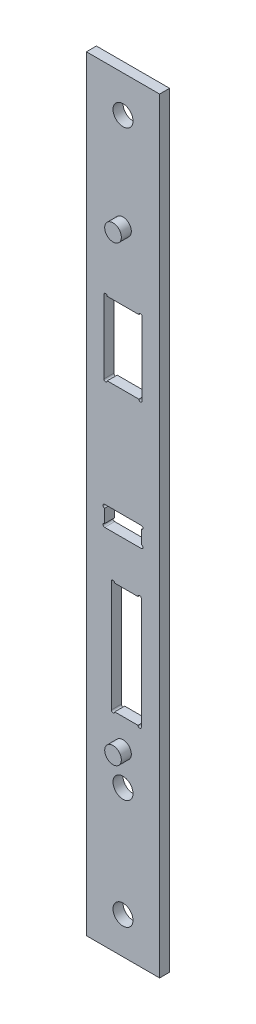
ISO-10303-21;
HEADER;
FILE_DESCRIPTION(('STEP AP214'),'2;1');
FILE_NAME('part.step','',(''),(''),'','','');
FILE_SCHEMA(('AUTOMOTIVE_DESIGN { 1 0 10303 214 1 1 1 1 }'));
ENDSEC;
DATA;
#1=APPLICATION_CONTEXT('core data for automotive mechanical design processes');
#2=APPLICATION_PROTOCOL_DEFINITION('international standard','automotive_design',2000,#1);
#3=PRODUCT_CONTEXT('',#1,'mechanical');
#4=PRODUCT('Part','Part','',(#3));
#5=PRODUCT_RELATED_PRODUCT_CATEGORY('part','',(#4));
#6=PRODUCT_DEFINITION_FORMATION('','',#4);
#7=PRODUCT_DEFINITION_CONTEXT('part definition',#1,'design');
#8=PRODUCT_DEFINITION('design','',#6,#7);
#9=PRODUCT_DEFINITION_SHAPE('','',#8);
#10=(LENGTH_UNIT() NAMED_UNIT(*) SI_UNIT(.MILLI.,.METRE.));
#11=(NAMED_UNIT(*) PLANE_ANGLE_UNIT() SI_UNIT($,.RADIAN.));
#12=(NAMED_UNIT(*) SI_UNIT($,.STERADIAN.) SOLID_ANGLE_UNIT());
#13=UNCERTAINTY_MEASURE_WITH_UNIT(LENGTH_MEASURE(1.E-05),#10,'distance_accuracy_value','');
#14=(GEOMETRIC_REPRESENTATION_CONTEXT(3) GLOBAL_UNCERTAINTY_ASSIGNED_CONTEXT((#13)) GLOBAL_UNIT_ASSIGNED_CONTEXT((#10,
#11,#12)) REPRESENTATION_CONTEXT('',''));
#15=CARTESIAN_POINT('',(0.,0.,0.));
#16=DIRECTION('',(0.,0.,1.));
#17=DIRECTION('',(1.,0.,0.));
#18=AXIS2_PLACEMENT_3D('',#15,#16,#17);
#19=CARTESIAN_POINT('',(-11.,-115.,1.5));
#20=DIRECTION('',(0.,0.,1.));
#21=DIRECTION('',(1.,0.,0.));
#22=AXIS2_PLACEMENT_3D('',#19,#20,#21);
#23=PLANE('',#22);
#24=CARTESIAN_POINT('',(0.,75.,1.5));
#25=DIRECTION('',(0.,0.,1.));
#26=DIRECTION('',(1.,0.,0.));
#27=AXIS2_PLACEMENT_3D('',#24,#25,#26);
#28=CIRCLE('',#27,2.5);
#29=CARTESIAN_POINT('',(2.50000000000004,75.,1.5));
#30=VERTEX_POINT('',#29);
#31=EDGE_CURVE('E619',#30,#30,#28,.T.);
#32=ORIENTED_EDGE('',*,*,#31,.F.);
#33=EDGE_LOOP('',(#32));
#34=FACE_BOUND('',#33,.T.);
#35=CARTESIAN_POINT('',(-2.99999999999997,-19.,1.5));
#36=DIRECTION('',(0.,0.,1.));
#37=DIRECTION('',(1.,0.,0.));
#38=AXIS2_PLACEMENT_3D('',#35,#36,#37);
#39=CIRCLE('',#38,0.499999999999999);
#40=CARTESIAN_POINT('',(-2.49999999999997,-19.,1.5));
#41=VERTEX_POINT('',#40);
#42=CARTESIAN_POINT('',(-3.49999999999996,-19.,1.5));
#43=VERTEX_POINT('',#42);
#44=EDGE_CURVE('E55',#41,#43,#39,.T.);
#45=ORIENTED_EDGE('',*,*,#44,.F.);
#46=DIRECTION('',(-1.,0.,0.));
#47=VECTOR('',#46,1.);
#48=CARTESIAN_POINT('',(-2.49999999999997,-19.,1.5));
#49=LINE('',#48,#47);
#50=CARTESIAN_POINT('',(4.50000000000004,-19.,1.5));
#51=VERTEX_POINT('',#50);
#52=EDGE_CURVE('E225',#51,#41,#49,.T.);
#53=ORIENTED_EDGE('',*,*,#52,.F.);
#54=CARTESIAN_POINT('',(5.00000000000003,-19.,1.5));
#55=DIRECTION('',(0.,0.,1.));
#56=DIRECTION('',(-1.,0.,0.));
#57=AXIS2_PLACEMENT_3D('',#54,#55,#56);
#58=CIRCLE('',#57,0.5);
#59=CARTESIAN_POINT('',(5.50000000000003,-19.,1.5));
#60=VERTEX_POINT('',#59);
#61=EDGE_CURVE('E259',#60,#51,#58,.T.);
#62=ORIENTED_EDGE('',*,*,#61,.F.);
#63=DIRECTION('',(0.,1.,0.));
#64=VECTOR('',#63,1.);
#65=CARTESIAN_POINT('',(5.50000000000003,-19.,1.5));
#66=LINE('',#65,#64);
#67=CARTESIAN_POINT('',(5.50000000000004,-52.5,1.5));
#68=VERTEX_POINT('',#67);
#69=EDGE_CURVE('E256',#68,#60,#66,.T.);
#70=ORIENTED_EDGE('',*,*,#69,.F.);
#71=CARTESIAN_POINT('',(5.00000000000003,-52.5,1.5));
#72=DIRECTION('',(0.,0.,1.));
#73=DIRECTION('',(-1.,0.,0.));
#74=AXIS2_PLACEMENT_3D('',#71,#72,#73);
#75=CIRCLE('',#74,0.500000000000002);
#76=CARTESIAN_POINT('',(4.50000000000003,-52.5,1.5));
#77=VERTEX_POINT('',#76);
#78=EDGE_CURVE('E253',#77,#68,#75,.T.);
#79=ORIENTED_EDGE('',*,*,#78,.F.);
#80=DIRECTION('',(1.,0.,0.));
#81=VECTOR('',#80,1.);
#82=CARTESIAN_POINT('',(-2.49999999999997,-52.5,1.5));
#83=LINE('',#82,#81);
#84=CARTESIAN_POINT('',(-2.49999999999997,-52.5,1.5));
#85=VERTEX_POINT('',#84);
#86=EDGE_CURVE('E250',#85,#77,#83,.T.);
#87=ORIENTED_EDGE('',*,*,#86,.F.);
#88=CARTESIAN_POINT('',(-2.99999999999997,-52.5,1.5));
#89=DIRECTION('',(0.,0.,1.));
#90=DIRECTION('',(1.,0.,0.));
#91=AXIS2_PLACEMENT_3D('',#88,#89,#90);
#92=CIRCLE('',#91,0.499999999999999);
#93=CARTESIAN_POINT('',(-3.49999999999997,-52.5,1.5));
#94=VERTEX_POINT('',#93);
#95=EDGE_CURVE('E247',#94,#85,#92,.T.);
#96=ORIENTED_EDGE('',*,*,#95,.F.);
#97=DIRECTION('',(0.,-1.,0.));
#98=VECTOR('',#97,1.);
#99=CARTESIAN_POINT('',(-3.49999999999997,-19.,1.5));
#100=LINE('',#99,#98);
#101=EDGE_CURVE('E240',#43,#94,#100,.T.);
#102=ORIENTED_EDGE('',*,*,#101,.F.);
#103=EDGE_LOOP('',(#45,#53,#62,#70,#79,#87,#96,#102));
#104=FACE_BOUND('',#103,.T.);
#105=CARTESIAN_POINT('',(-5.5,-0.5,1.5));
#106=DIRECTION('',(0.,0.,1.));
#107=DIRECTION('',(1.,0.,0.));
#108=AXIS2_PLACEMENT_3D('',#105,#106,#107);
#109=CIRCLE('',#108,0.5);
#110=CARTESIAN_POINT('',(-5.5,0.,1.5));
#111=VERTEX_POINT('',#110);
#112=CARTESIAN_POINT('',(-5.5,-1.,1.5));
#113=VERTEX_POINT('',#112);
#114=EDGE_CURVE('E295',#111,#113,#109,.T.);
#115=ORIENTED_EDGE('',*,*,#114,.F.);
#116=DIRECTION('',(-1.,0.,0.));
#117=VECTOR('',#116,1.);
#118=CARTESIAN_POINT('',(-5.5,0.,1.5));
#119=LINE('',#118,#117);
#120=CARTESIAN_POINT('',(5.5,0.,1.5));
#121=VERTEX_POINT('',#120);
#122=EDGE_CURVE('E315',#121,#111,#119,.T.);
#123=ORIENTED_EDGE('',*,*,#122,.F.);
#124=CARTESIAN_POINT('',(5.5,-0.5,1.5));
#125=DIRECTION('',(0.,0.,1.));
#126=DIRECTION('',(-1.,0.,0.));
#127=AXIS2_PLACEMENT_3D('',#124,#125,#126);
#128=CIRCLE('',#127,0.5);
#129=CARTESIAN_POINT('',(5.5,-1.,1.5));
#130=VERTEX_POINT('',#129);
#131=EDGE_CURVE('E312',#130,#121,#128,.T.);
#132=ORIENTED_EDGE('',*,*,#131,.F.);
#133=DIRECTION('',(0.,1.,0.));
#134=VECTOR('',#133,1.);
#135=CARTESIAN_POINT('',(5.5,-1.,1.5));
#136=LINE('',#135,#134);
#137=CARTESIAN_POINT('',(5.5,-5.,1.5));
#138=VERTEX_POINT('',#137);
#139=EDGE_CURVE('E309',#138,#130,#136,.T.);
#140=ORIENTED_EDGE('',*,*,#139,.F.);
#141=CARTESIAN_POINT('',(5.5,-5.5,1.5));
#142=DIRECTION('',(0.,0.,1.));
#143=DIRECTION('',(-1.,0.,0.));
#144=AXIS2_PLACEMENT_3D('',#141,#142,#143);
#145=CIRCLE('',#144,0.5);
#146=CARTESIAN_POINT('',(5.5,-6.,1.5));
#147=VERTEX_POINT('',#146);
#148=EDGE_CURVE('E306',#147,#138,#145,.T.);
#149=ORIENTED_EDGE('',*,*,#148,.F.);
#150=DIRECTION('',(1.,0.,0.));
#151=VECTOR('',#150,1.);
#152=CARTESIAN_POINT('',(-5.5,-6.,1.5));
#153=LINE('',#152,#151);
#154=CARTESIAN_POINT('',(-5.5,-6.,1.5));
#155=VERTEX_POINT('',#154);
#156=EDGE_CURVE('E303',#155,#147,#153,.T.);
#157=ORIENTED_EDGE('',*,*,#156,.F.);
#158=CARTESIAN_POINT('',(-5.5,-5.5,1.5));
#159=DIRECTION('',(0.,0.,1.));
#160=DIRECTION('',(1.,0.,0.));
#161=AXIS2_PLACEMENT_3D('',#158,#159,#160);
#162=CIRCLE('',#161,0.5);
#163=CARTESIAN_POINT('',(-5.5,-5.,1.5));
#164=VERTEX_POINT('',#163);
#165=EDGE_CURVE('E300',#164,#155,#162,.T.);
#166=ORIENTED_EDGE('',*,*,#165,.F.);
#167=DIRECTION('',(0.,-1.,0.));
#168=VECTOR('',#167,1.);
#169=CARTESIAN_POINT('',(-5.5,-1.,1.5));
#170=LINE('',#169,#168);
#171=EDGE_CURVE('E297',#113,#164,#170,.T.);
#172=ORIENTED_EDGE('',*,*,#171,.F.);
#173=EDGE_LOOP('',(#115,#123,#132,#140,#149,#157,#166,#172));
#174=FACE_BOUND('',#173,.T.);
#175=CARTESIAN_POINT('',(-5.25,54.5,1.5));
#176=DIRECTION('',(0.,0.,1.));
#177=DIRECTION('',(1.,0.,0.));
#178=AXIS2_PLACEMENT_3D('',#175,#176,#177);
#179=CIRCLE('',#178,0.5);
#180=CARTESIAN_POINT('',(-4.75,54.5,1.5));
#181=VERTEX_POINT('',#180);
#182=CARTESIAN_POINT('',(-5.75,54.5,1.5));
#183=VERTEX_POINT('',#182);
#184=EDGE_CURVE('E358',#181,#183,#179,.T.);
#185=ORIENTED_EDGE('',*,*,#184,.F.);
#186=DIRECTION('',(-1.,0.,0.));
#187=VECTOR('',#186,1.);
#188=CARTESIAN_POINT('',(-4.75,54.5,1.5));
#189=LINE('',#188,#187);
#190=CARTESIAN_POINT('',(4.75,54.5,1.5));
#191=VERTEX_POINT('',#190);
#192=EDGE_CURVE('E378',#191,#181,#189,.T.);
#193=ORIENTED_EDGE('',*,*,#192,.F.);
#194=CARTESIAN_POINT('',(5.25,54.5,1.5));
#195=DIRECTION('',(0.,0.,1.));
#196=DIRECTION('',(1.,0.,0.));
#197=AXIS2_PLACEMENT_3D('',#194,#195,#196);
#198=CIRCLE('',#197,0.5);
#199=CARTESIAN_POINT('',(5.75,54.5,1.5));
#200=VERTEX_POINT('',#199);
#201=EDGE_CURVE('E375',#200,#191,#198,.T.);
#202=ORIENTED_EDGE('',*,*,#201,.F.);
#203=DIRECTION('',(0.,1.,0.));
#204=VECTOR('',#203,1.);
#205=CARTESIAN_POINT('',(5.75,54.5,1.5));
#206=LINE('',#205,#204);
#207=CARTESIAN_POINT('',(5.75,32.5,1.5));
#208=VERTEX_POINT('',#207);
#209=EDGE_CURVE('E372',#208,#200,#206,.T.);
#210=ORIENTED_EDGE('',*,*,#209,.F.);
#211=CARTESIAN_POINT('',(5.25,32.5,1.5));
#212=DIRECTION('',(0.,0.,1.));
#213=DIRECTION('',(-1.,0.,0.));
#214=AXIS2_PLACEMENT_3D('',#211,#212,#213);
#215=CIRCLE('',#214,0.5);
#216=CARTESIAN_POINT('',(4.75,32.5,1.5));
#217=VERTEX_POINT('',#216);
#218=EDGE_CURVE('E369',#217,#208,#215,.T.);
#219=ORIENTED_EDGE('',*,*,#218,.F.);
#220=DIRECTION('',(1.,0.,0.));
#221=VECTOR('',#220,1.);
#222=CARTESIAN_POINT('',(-4.75,32.5,1.5));
#223=LINE('',#222,#221);
#224=CARTESIAN_POINT('',(-4.75,32.5,1.5));
#225=VERTEX_POINT('',#224);
#226=EDGE_CURVE('E366',#225,#217,#223,.T.);
#227=ORIENTED_EDGE('',*,*,#226,.F.);
#228=CARTESIAN_POINT('',(-5.25,32.5,1.5));
#229=DIRECTION('',(0.,0.,1.));
#230=DIRECTION('',(1.,0.,0.));
#231=AXIS2_PLACEMENT_3D('',#228,#229,#230);
#232=CIRCLE('',#231,0.5);
#233=CARTESIAN_POINT('',(-5.75,32.5,1.5));
#234=VERTEX_POINT('',#233);
#235=EDGE_CURVE('E363',#234,#225,#232,.T.);
#236=ORIENTED_EDGE('',*,*,#235,.F.);
#237=DIRECTION('',(0.,-1.,0.));
#238=VECTOR('',#237,1.);
#239=CARTESIAN_POINT('',(-5.75,54.5,1.5));
#240=LINE('',#239,#238);
#241=EDGE_CURVE('E360',#183,#234,#240,.T.);
#242=ORIENTED_EDGE('',*,*,#241,.F.);
#243=EDGE_LOOP('',(#185,#193,#202,#210,#219,#227,#236,#242));
#244=FACE_BOUND('',#243,.T.);
#245=CARTESIAN_POINT('',(0.,104.,1.5));
#246=DIRECTION('',(0.,0.,1.));
#247=DIRECTION('',(1.,0.,0.));
#248=AXIS2_PLACEMENT_3D('',#245,#246,#247);
#249=CIRCLE('',#248,3.);
#250=CARTESIAN_POINT('',(3.00000000000004,104.,1.5));
#251=VERTEX_POINT('',#250);
#252=EDGE_CURVE('E401',#251,#251,#249,.T.);
#253=ORIENTED_EDGE('',*,*,#252,.F.);
#254=EDGE_LOOP('',(#253));
#255=FACE_BOUND('',#254,.T.);
#256=CARTESIAN_POINT('',(0.,-71.,1.5));
#257=DIRECTION('',(0.,0.,1.));
#258=DIRECTION('',(1.,0.,0.));
#259=AXIS2_PLACEMENT_3D('',#256,#257,#258);
#260=CIRCLE('',#259,3.);
#261=CARTESIAN_POINT('',(3.,-71.,1.5));
#262=VERTEX_POINT('',#261);
#263=EDGE_CURVE('E407',#262,#262,#260,.T.);
#264=ORIENTED_EDGE('',*,*,#263,.F.);
#265=EDGE_LOOP('',(#264));
#266=FACE_BOUND('',#265,.T.);
#267=CARTESIAN_POINT('',(0.,-104.,1.5));
#268=DIRECTION('',(0.,0.,1.));
#269=DIRECTION('',(1.,0.,0.));
#270=AXIS2_PLACEMENT_3D('',#267,#268,#269);
#271=CIRCLE('',#270,3.);
#272=CARTESIAN_POINT('',(3.,-104.,1.5));
#273=VERTEX_POINT('',#272);
#274=EDGE_CURVE('E413',#273,#273,#271,.T.);
#275=ORIENTED_EDGE('',*,*,#274,.F.);
#276=EDGE_LOOP('',(#275));
#277=FACE_BOUND('',#276,.T.);
#278=DIRECTION('',(0.,-1.,0.));
#279=VECTOR('',#278,1.);
#280=CARTESIAN_POINT('',(-11.,115.,1.5));
#281=LINE('',#280,#279);
#282=CARTESIAN_POINT('',(-11.,115.,1.5));
#283=VERTEX_POINT('',#282);
#284=CARTESIAN_POINT('',(-11.,-115.,1.5));
#285=VERTEX_POINT('',#284);
#286=EDGE_CURVE('E420',#283,#285,#281,.T.);
#287=ORIENTED_EDGE('',*,*,#286,.T.);
#288=DIRECTION('',(1.,0.,0.));
#289=VECTOR('',#288,1.);
#290=CARTESIAN_POINT('',(-11.,-115.,1.5));
#291=LINE('',#290,#289);
#292=CARTESIAN_POINT('',(11.,-115.,1.5));
#293=VERTEX_POINT('',#292);
#294=EDGE_CURVE('E424',#285,#293,#291,.T.);
#295=ORIENTED_EDGE('',*,*,#294,.T.);
#296=DIRECTION('',(0.,1.,0.));
#297=VECTOR('',#296,1.);
#298=CARTESIAN_POINT('',(11.,115.,1.5));
#299=LINE('',#298,#297);
#300=CARTESIAN_POINT('',(11.,115.,1.5));
#301=VERTEX_POINT('',#300);
#302=EDGE_CURVE('E427',#293,#301,#299,.T.);
#303=ORIENTED_EDGE('',*,*,#302,.T.);
#304=DIRECTION('',(-1.,0.,0.));
#305=VECTOR('',#304,1.);
#306=CARTESIAN_POINT('',(-11.,115.,1.5));
#307=LINE('',#306,#305);
#308=EDGE_CURVE('E430',#301,#283,#307,.T.);
#309=ORIENTED_EDGE('',*,*,#308,.T.);
#310=EDGE_LOOP('',(#287,#295,#303,#309));
#311=FACE_BOUND('',#310,.T.);
#312=CARTESIAN_POINT('',(0.,-61.,1.5));
#313=DIRECTION('',(0.,0.,1.));
#314=DIRECTION('',(1.,0.,0.));
#315=AXIS2_PLACEMENT_3D('',#312,#313,#314);
#316=CIRCLE('',#315,2.5);
#317=CARTESIAN_POINT('',(2.50000000000004,-61.,1.5));
#318=VERTEX_POINT('',#317);
#319=EDGE_CURVE('E620',#318,#318,#316,.T.);
#320=ORIENTED_EDGE('',*,*,#319,.F.);
#321=EDGE_LOOP('',(#320));
#322=FACE_BOUND('',#321,.T.);
#323=ADVANCED_FACE('F32',(#34,#104,#174,#244,#255,#266,#277,#311,#322),#23,.T.);
#324=CARTESIAN_POINT('',(-11.,-115.,-1.5));
#325=DIRECTION('',(0.,0.,1.));
#326=DIRECTION('',(1.,0.,0.));
#327=AXIS2_PLACEMENT_3D('',#324,#325,#326);
#328=PLANE('',#327);
#329=DIRECTION('',(1.,0.,0.));
#330=VECTOR('',#329,1.);
#331=CARTESIAN_POINT('',(-2.49999999999997,-19.,-1.5));
#332=LINE('',#331,#330);
#333=CARTESIAN_POINT('',(-2.49999999999997,-19.,-1.5));
#334=VERTEX_POINT('',#333);
#335=CARTESIAN_POINT('',(4.50000000000004,-19.,-1.5));
#336=VERTEX_POINT('',#335);
#337=EDGE_CURVE('E238',#334,#336,#332,.T.);
#338=ORIENTED_EDGE('',*,*,#337,.F.);
#339=CARTESIAN_POINT('',(-2.99999999999997,-19.,-1.5));
#340=DIRECTION('',(0.,0.,1.));
#341=DIRECTION('',(1.,0.,0.));
#342=AXIS2_PLACEMENT_3D('',#339,#340,#341);
#343=CIRCLE('',#342,0.499999999999999);
#344=CARTESIAN_POINT('',(-3.49999999999997,-19.,-1.5));
#345=VERTEX_POINT('',#344);
#346=EDGE_CURVE('E219',#345,#334,#343,.F.);
#347=ORIENTED_EDGE('',*,*,#346,.F.);
#348=DIRECTION('',(0.,1.,0.));
#349=VECTOR('',#348,1.);
#350=CARTESIAN_POINT('',(-3.49999999999997,-19.,-1.5));
#351=LINE('',#350,#349);
#352=CARTESIAN_POINT('',(-3.49999999999997,-52.5,-1.5));
#353=VERTEX_POINT('',#352);
#354=EDGE_CURVE('E228',#353,#345,#351,.T.);
#355=ORIENTED_EDGE('',*,*,#354,.F.);
#356=CARTESIAN_POINT('',(-2.99999999999997,-52.5,-1.5));
#357=DIRECTION('',(0.,0.,1.));
#358=DIRECTION('',(1.,0.,0.));
#359=AXIS2_PLACEMENT_3D('',#356,#357,#358);
#360=CIRCLE('',#359,0.499999999999999);
#361=CARTESIAN_POINT('',(-2.49999999999997,-52.5,-1.5));
#362=VERTEX_POINT('',#361);
#363=EDGE_CURVE('E47',#362,#353,#360,.F.);
#364=ORIENTED_EDGE('',*,*,#363,.F.);
#365=DIRECTION('',(-1.,0.,0.));
#366=VECTOR('',#365,1.);
#367=CARTESIAN_POINT('',(-2.49999999999997,-52.5,-1.5));
#368=LINE('',#367,#366);
#369=CARTESIAN_POINT('',(4.50000000000003,-52.5,-1.5));
#370=VERTEX_POINT('',#369);
#371=EDGE_CURVE('E631',#370,#362,#368,.T.);
#372=ORIENTED_EDGE('',*,*,#371,.F.);
#373=CARTESIAN_POINT('',(5.00000000000003,-52.5,-1.5));
#374=DIRECTION('',(0.,0.,1.));
#375=DIRECTION('',(1.,0.,0.));
#376=AXIS2_PLACEMENT_3D('',#373,#374,#375);
#377=CIRCLE('',#376,0.500000000000002);
#378=CARTESIAN_POINT('',(5.50000000000004,-52.5,-1.5));
#379=VERTEX_POINT('',#378);
#380=EDGE_CURVE('E634',#379,#370,#377,.F.);
#381=ORIENTED_EDGE('',*,*,#380,.F.);
#382=DIRECTION('',(0.,-1.,0.));
#383=VECTOR('',#382,1.);
#384=CARTESIAN_POINT('',(5.50000000000003,-19.,-1.5));
#385=LINE('',#384,#383);
#386=CARTESIAN_POINT('',(5.50000000000003,-19.,-1.5));
#387=VERTEX_POINT('',#386);
#388=EDGE_CURVE('E637',#387,#379,#385,.T.);
#389=ORIENTED_EDGE('',*,*,#388,.F.);
#390=CARTESIAN_POINT('',(5.00000000000003,-19.,-1.5));
#391=DIRECTION('',(0.,0.,1.));
#392=DIRECTION('',(1.,0.,0.));
#393=AXIS2_PLACEMENT_3D('',#390,#391,#392);
#394=CIRCLE('',#393,0.5);
#395=EDGE_CURVE('E242',#336,#387,#394,.F.);
#396=ORIENTED_EDGE('',*,*,#395,.F.);
#397=EDGE_LOOP('',(#338,#347,#355,#364,#372,#381,#389,#396));
#398=FACE_BOUND('',#397,.T.);
#399=DIRECTION('',(1.,0.,0.));
#400=VECTOR('',#399,1.);
#401=CARTESIAN_POINT('',(-5.5,0.,-1.5));
#402=LINE('',#401,#400);
#403=CARTESIAN_POINT('',(-5.5,0.,-1.5));
#404=VERTEX_POINT('',#403);
#405=CARTESIAN_POINT('',(5.5,0.,-1.5));
#406=VERTEX_POINT('',#405);
#407=EDGE_CURVE('E289',#404,#406,#402,.T.);
#408=ORIENTED_EDGE('',*,*,#407,.F.);
#409=CARTESIAN_POINT('',(-5.5,-0.5,-1.5));
#410=DIRECTION('',(0.,0.,1.));
#411=DIRECTION('',(1.,0.,0.));
#412=AXIS2_PLACEMENT_3D('',#409,#410,#411);
#413=CIRCLE('',#412,0.5);
#414=CARTESIAN_POINT('',(-5.5,-1.,-1.5));
#415=VERTEX_POINT('',#414);
#416=EDGE_CURVE('E292',#415,#404,#413,.F.);
#417=ORIENTED_EDGE('',*,*,#416,.F.);
#418=DIRECTION('',(0.,1.,0.));
#419=VECTOR('',#418,1.);
#420=CARTESIAN_POINT('',(-5.5,-1.,-1.5));
#421=LINE('',#420,#419);
#422=CARTESIAN_POINT('',(-5.5,-5.,-1.5));
#423=VERTEX_POINT('',#422);
#424=EDGE_CURVE('E321',#423,#415,#421,.T.);
#425=ORIENTED_EDGE('',*,*,#424,.F.);
#426=CARTESIAN_POINT('',(-5.5,-5.5,-1.5));
#427=DIRECTION('',(0.,0.,1.));
#428=DIRECTION('',(1.,0.,0.));
#429=AXIS2_PLACEMENT_3D('',#426,#427,#428);
#430=CIRCLE('',#429,0.5);
#431=CARTESIAN_POINT('',(-5.5,-6.,-1.5));
#432=VERTEX_POINT('',#431);
#433=EDGE_CURVE('E231',#432,#423,#430,.F.);
#434=ORIENTED_EDGE('',*,*,#433,.F.);
#435=DIRECTION('',(-1.,0.,0.));
#436=VECTOR('',#435,1.);
#437=CARTESIAN_POINT('',(-5.5,-6.,-1.5));
#438=LINE('',#437,#436);
#439=CARTESIAN_POINT('',(5.5,-6.,-1.5));
#440=VERTEX_POINT('',#439);
#441=EDGE_CURVE('E277',#440,#432,#438,.T.);
#442=ORIENTED_EDGE('',*,*,#441,.F.);
#443=CARTESIAN_POINT('',(5.5,-5.5,-1.5));
#444=DIRECTION('',(0.,0.,1.));
#445=DIRECTION('',(1.,0.,0.));
#446=AXIS2_PLACEMENT_3D('',#443,#444,#445);
#447=CIRCLE('',#446,0.5);
#448=CARTESIAN_POINT('',(5.5,-5.,-1.5));
#449=VERTEX_POINT('',#448);
#450=EDGE_CURVE('E280',#449,#440,#447,.F.);
#451=ORIENTED_EDGE('',*,*,#450,.F.);
#452=DIRECTION('',(0.,-1.,0.));
#453=VECTOR('',#452,1.);
#454=CARTESIAN_POINT('',(5.5,-1.,-1.5));
#455=LINE('',#454,#453);
#456=CARTESIAN_POINT('',(5.5,-1.,-1.5));
#457=VERTEX_POINT('',#456);
#458=EDGE_CURVE('E283',#457,#449,#455,.T.);
#459=ORIENTED_EDGE('',*,*,#458,.F.);
#460=CARTESIAN_POINT('',(5.5,-0.5,-1.5));
#461=DIRECTION('',(0.,0.,1.));
#462=DIRECTION('',(1.,0.,0.));
#463=AXIS2_PLACEMENT_3D('',#460,#461,#462);
#464=CIRCLE('',#463,0.5);
#465=EDGE_CURVE('E286',#406,#457,#464,.F.);
#466=ORIENTED_EDGE('',*,*,#465,.F.);
#467=EDGE_LOOP('',(#408,#417,#425,#434,#442,#451,#459,#466));
#468=FACE_BOUND('',#467,.T.);
#469=DIRECTION('',(1.,0.,0.));
#470=VECTOR('',#469,1.);
#471=CARTESIAN_POINT('',(-4.75,54.5,-1.5));
#472=LINE('',#471,#470);
#473=CARTESIAN_POINT('',(-4.75,54.5,-1.5));
#474=VERTEX_POINT('',#473);
#475=CARTESIAN_POINT('',(4.75,54.5,-1.5));
#476=VERTEX_POINT('',#475);
#477=EDGE_CURVE('E352',#474,#476,#472,.T.);
#478=ORIENTED_EDGE('',*,*,#477,.F.);
#479=CARTESIAN_POINT('',(-5.25,54.5,-1.5));
#480=DIRECTION('',(0.,0.,1.));
#481=DIRECTION('',(1.,0.,0.));
#482=AXIS2_PLACEMENT_3D('',#479,#480,#481);
#483=CIRCLE('',#482,0.5);
#484=CARTESIAN_POINT('',(-5.75,54.5,-1.5));
#485=VERTEX_POINT('',#484);
#486=EDGE_CURVE('E355',#485,#474,#483,.F.);
#487=ORIENTED_EDGE('',*,*,#486,.F.);
#488=DIRECTION('',(0.,1.,0.));
#489=VECTOR('',#488,1.);
#490=CARTESIAN_POINT('',(-5.75,54.5,-1.5));
#491=LINE('',#490,#489);
#492=CARTESIAN_POINT('',(-5.75,32.5,-1.5));
#493=VERTEX_POINT('',#492);
#494=EDGE_CURVE('E384',#493,#485,#491,.T.);
#495=ORIENTED_EDGE('',*,*,#494,.F.);
#496=CARTESIAN_POINT('',(-5.25,32.5,-1.5));
#497=DIRECTION('',(0.,0.,1.));
#498=DIRECTION('',(1.,0.,0.));
#499=AXIS2_PLACEMENT_3D('',#496,#497,#498);
#500=CIRCLE('',#499,0.5);
#501=CARTESIAN_POINT('',(-4.75,32.5,-1.5));
#502=VERTEX_POINT('',#501);
#503=EDGE_CURVE('E338',#502,#493,#500,.F.);
#504=ORIENTED_EDGE('',*,*,#503,.F.);
#505=DIRECTION('',(-1.,0.,0.));
#506=VECTOR('',#505,1.);
#507=CARTESIAN_POINT('',(-4.75,32.5,-1.5));
#508=LINE('',#507,#506);
#509=CARTESIAN_POINT('',(4.75,32.5,-1.5));
#510=VERTEX_POINT('',#509);
#511=EDGE_CURVE('E340',#510,#502,#508,.T.);
#512=ORIENTED_EDGE('',*,*,#511,.F.);
#513=CARTESIAN_POINT('',(5.25,32.5,-1.5));
#514=DIRECTION('',(0.,0.,1.));
#515=DIRECTION('',(1.,0.,0.));
#516=AXIS2_PLACEMENT_3D('',#513,#514,#515);
#517=CIRCLE('',#516,0.5);
#518=CARTESIAN_POINT('',(5.75,32.5,-1.5));
#519=VERTEX_POINT('',#518);
#520=EDGE_CURVE('E343',#519,#510,#517,.F.);
#521=ORIENTED_EDGE('',*,*,#520,.F.);
#522=DIRECTION('',(0.,-1.,0.));
#523=VECTOR('',#522,1.);
#524=CARTESIAN_POINT('',(5.75,54.5,-1.5));
#525=LINE('',#524,#523);
#526=CARTESIAN_POINT('',(5.75,54.5,-1.5));
#527=VERTEX_POINT('',#526);
#528=EDGE_CURVE('E346',#527,#519,#525,.T.);
#529=ORIENTED_EDGE('',*,*,#528,.F.);
#530=CARTESIAN_POINT('',(5.25,54.5,-1.5));
#531=DIRECTION('',(0.,0.,1.));
#532=DIRECTION('',(1.,0.,0.));
#533=AXIS2_PLACEMENT_3D('',#530,#531,#532);
#534=CIRCLE('',#533,0.5);
#535=EDGE_CURVE('E349',#476,#527,#534,.F.);
#536=ORIENTED_EDGE('',*,*,#535,.F.);
#537=EDGE_LOOP('',(#478,#487,#495,#504,#512,#521,#529,#536));
#538=FACE_BOUND('',#537,.T.);
#539=CARTESIAN_POINT('',(0.,104.,-1.5));
#540=DIRECTION('',(0.,0.,1.));
#541=DIRECTION('',(1.,0.,0.));
#542=AXIS2_PLACEMENT_3D('',#539,#540,#541);
#543=CIRCLE('',#542,3.);
#544=CARTESIAN_POINT('',(3.00000000000004,104.,-1.5));
#545=VERTEX_POINT('',#544);
#546=EDGE_CURVE('E404',#545,#545,#543,.F.);
#547=ORIENTED_EDGE('',*,*,#546,.F.);
#548=EDGE_LOOP('',(#547));
#549=FACE_BOUND('',#548,.T.);
#550=CARTESIAN_POINT('',(0.,-71.,-1.5));
#551=DIRECTION('',(0.,0.,1.));
#552=DIRECTION('',(1.,0.,0.));
#553=AXIS2_PLACEMENT_3D('',#550,#551,#552);
#554=CIRCLE('',#553,3.);
#555=CARTESIAN_POINT('',(3.,-71.,-1.5));
#556=VERTEX_POINT('',#555);
#557=EDGE_CURVE('E410',#556,#556,#554,.F.);
#558=ORIENTED_EDGE('',*,*,#557,.F.);
#559=EDGE_LOOP('',(#558));
#560=FACE_BOUND('',#559,.T.);
#561=DIRECTION('',(0.,-1.,0.));
#562=VECTOR('',#561,1.);
#563=CARTESIAN_POINT('',(-11.,115.,-1.5));
#564=LINE('',#563,#562);
#565=CARTESIAN_POINT('',(-11.,115.,-1.5));
#566=VERTEX_POINT('',#565);
#567=CARTESIAN_POINT('',(-11.,-115.,-1.5));
#568=VERTEX_POINT('',#567);
#569=EDGE_CURVE('E419',#566,#568,#564,.T.);
#570=ORIENTED_EDGE('',*,*,#569,.F.);
#571=DIRECTION('',(-1.,0.,0.));
#572=VECTOR('',#571,1.);
#573=CARTESIAN_POINT('',(-11.,115.,-1.5));
#574=LINE('',#573,#572);
#575=CARTESIAN_POINT('',(11.,115.,-1.5));
#576=VERTEX_POINT('',#575);
#577=EDGE_CURVE('E425',#576,#566,#574,.T.);
#578=ORIENTED_EDGE('',*,*,#577,.F.);
#579=DIRECTION('',(0.,1.,0.));
#580=VECTOR('',#579,1.);
#581=CARTESIAN_POINT('',(11.,115.,-1.5));
#582=LINE('',#581,#580);
#583=CARTESIAN_POINT('',(11.,-115.,-1.5));
#584=VERTEX_POINT('',#583);
#585=EDGE_CURVE('E437',#584,#576,#582,.T.);
#586=ORIENTED_EDGE('',*,*,#585,.F.);
#587=DIRECTION('',(1.,0.,0.));
#588=VECTOR('',#587,1.);
#589=CARTESIAN_POINT('',(-11.,-115.,-1.5));
#590=LINE('',#589,#588);
#591=EDGE_CURVE('E435',#568,#584,#590,.T.);
#592=ORIENTED_EDGE('',*,*,#591,.F.);
#593=EDGE_LOOP('',(#570,#578,#586,#592));
#594=FACE_BOUND('',#593,.T.);
#595=CARTESIAN_POINT('',(0.,-104.,-1.5));
#596=DIRECTION('',(0.,0.,1.));
#597=DIRECTION('',(1.,0.,0.));
#598=AXIS2_PLACEMENT_3D('',#595,#596,#597);
#599=CIRCLE('',#598,3.);
#600=CARTESIAN_POINT('',(3.,-104.,-1.5));
#601=VERTEX_POINT('',#600);
#602=EDGE_CURVE('E416',#601,#601,#599,.F.);
#603=ORIENTED_EDGE('',*,*,#602,.F.);
#604=EDGE_LOOP('',(#603));
#605=FACE_BOUND('',#604,.T.);
#606=ADVANCED_FACE('F234',(#398,#468,#538,#549,#560,#594,#605),#328,.F.);
#607=CARTESIAN_POINT('',(-11.,115.,1.5));
#608=DIRECTION('',(1.,0.,0.));
#609=DIRECTION('',(0.,1.,0.));
#610=AXIS2_PLACEMENT_3D('',#607,#608,#609);
#611=PLANE('',#610);
#612=ORIENTED_EDGE('',*,*,#569,.T.);
#613=DIRECTION('',(0.,0.,-1.));
#614=VECTOR('',#613,1.);
#615=CARTESIAN_POINT('',(-11.,-115.,1.5));
#616=LINE('',#615,#614);
#617=EDGE_CURVE('E11',#285,#568,#616,.T.);
#618=ORIENTED_EDGE('',*,*,#617,.F.);
#619=ORIENTED_EDGE('',*,*,#286,.F.);
#620=DIRECTION('',(0.,0.,-1.));
#621=VECTOR('',#620,1.);
#622=CARTESIAN_POINT('',(-11.,115.,1.5));
#623=LINE('',#622,#621);
#624=EDGE_CURVE('E432',#283,#566,#623,.T.);
#625=ORIENTED_EDGE('',*,*,#624,.T.);
#626=EDGE_LOOP('',(#612,#618,#619,#625));
#627=FACE_BOUND('',#626,.T.);
#628=ADVANCED_FACE('F34',(#627),#611,.F.);
#629=CARTESIAN_POINT('',(-11.,-115.,1.5));
#630=DIRECTION('',(0.,1.,0.));
#631=DIRECTION('',(0.,0.,1.));
#632=AXIS2_PLACEMENT_3D('',#629,#630,#631);
#633=PLANE('',#632);
#634=ORIENTED_EDGE('',*,*,#591,.T.);
#635=DIRECTION('',(0.,0.,-1.));
#636=VECTOR('',#635,1.);
#637=CARTESIAN_POINT('',(11.,-115.,1.5));
#638=LINE('',#637,#636);
#639=EDGE_CURVE('E40',#293,#584,#638,.T.);
#640=ORIENTED_EDGE('',*,*,#639,.F.);
#641=ORIENTED_EDGE('',*,*,#294,.F.);
#642=ORIENTED_EDGE('',*,*,#617,.T.);
#643=EDGE_LOOP('',(#634,#640,#641,#642));
#644=FACE_BOUND('',#643,.T.);
#645=ADVANCED_FACE('F466',(#644),#633,.F.);
#646=CARTESIAN_POINT('',(11.,115.,1.5));
#647=DIRECTION('',(-1.,0.,0.));
#648=DIRECTION('',(0.,-1.,0.));
#649=AXIS2_PLACEMENT_3D('',#646,#647,#648);
#650=PLANE('',#649);
#651=ORIENTED_EDGE('',*,*,#585,.T.);
#652=DIRECTION('',(0.,0.,-1.));
#653=VECTOR('',#652,1.);
#654=CARTESIAN_POINT('',(11.,115.,1.5));
#655=LINE('',#654,#653);
#656=EDGE_CURVE('E443',#301,#576,#655,.T.);
#657=ORIENTED_EDGE('',*,*,#656,.F.);
#658=ORIENTED_EDGE('',*,*,#302,.F.);
#659=ORIENTED_EDGE('',*,*,#639,.T.);
#660=EDGE_LOOP('',(#651,#657,#658,#659));
#661=FACE_BOUND('',#660,.T.);
#662=ADVANCED_FACE('F450',(#661),#650,.F.);
#663=CARTESIAN_POINT('',(-11.,115.,1.5));
#664=DIRECTION('',(0.,-1.,0.));
#665=DIRECTION('',(0.,0.,-1.));
#666=AXIS2_PLACEMENT_3D('',#663,#664,#665);
#667=PLANE('',#666);
#668=ORIENTED_EDGE('',*,*,#577,.T.);
#669=ORIENTED_EDGE('',*,*,#624,.F.);
#670=ORIENTED_EDGE('',*,*,#308,.F.);
#671=ORIENTED_EDGE('',*,*,#656,.T.);
#672=EDGE_LOOP('',(#668,#669,#670,#671));
#673=FACE_BOUND('',#672,.T.);
#674=ADVANCED_FACE('F459',(#673),#667,.F.);
#675=CARTESIAN_POINT('',(0.,-104.,1.5));
#676=DIRECTION('',(0.,0.,1.));
#677=DIRECTION('',(1.,0.,0.));
#678=AXIS2_PLACEMENT_3D('',#675,#676,#677);
#679=CYLINDRICAL_SURFACE('',#678,3.);
#680=ORIENTED_EDGE('',*,*,#602,.T.);
#681=EDGE_LOOP('',(#680));
#682=FACE_BOUND('',#681,.T.);
#683=ORIENTED_EDGE('',*,*,#274,.T.);
#684=EDGE_LOOP('',(#683));
#685=FACE_BOUND('',#684,.T.);
#686=ADVANCED_FACE('F483',(#682,#685),#679,.F.);
#687=CARTESIAN_POINT('',(0.,-71.,1.5));
#688=DIRECTION('',(0.,0.,1.));
#689=DIRECTION('',(1.,0.,0.));
#690=AXIS2_PLACEMENT_3D('',#687,#688,#689);
#691=CYLINDRICAL_SURFACE('',#690,3.);
#692=ORIENTED_EDGE('',*,*,#557,.T.);
#693=EDGE_LOOP('',(#692));
#694=FACE_BOUND('',#693,.T.);
#695=ORIENTED_EDGE('',*,*,#263,.T.);
#696=EDGE_LOOP('',(#695));
#697=FACE_BOUND('',#696,.T.);
#698=ADVANCED_FACE('F490',(#694,#697),#691,.F.);
#699=CARTESIAN_POINT('',(0.,104.,1.5));
#700=DIRECTION('',(0.,0.,1.));
#701=DIRECTION('',(1.,0.,0.));
#702=AXIS2_PLACEMENT_3D('',#699,#700,#701);
#703=CYLINDRICAL_SURFACE('',#702,3.);
#704=ORIENTED_EDGE('',*,*,#546,.T.);
#705=EDGE_LOOP('',(#704));
#706=FACE_BOUND('',#705,.T.);
#707=ORIENTED_EDGE('',*,*,#252,.T.);
#708=EDGE_LOOP('',(#707));
#709=FACE_BOUND('',#708,.T.);
#710=ADVANCED_FACE('F495',(#706,#709),#703,.F.);
#711=CARTESIAN_POINT('',(-5.25,54.5,-1.501));
#712=DIRECTION('',(0.,0.,1.));
#713=DIRECTION('',(1.,0.,0.));
#714=AXIS2_PLACEMENT_3D('',#711,#712,#713);
#715=CYLINDRICAL_SURFACE('',#714,0.5);
#716=ORIENTED_EDGE('',*,*,#486,.T.);
#717=DIRECTION('',(0.,0.,1.));
#718=VECTOR('',#717,1.);
#719=CARTESIAN_POINT('',(-4.75,54.5,-1.501));
#720=LINE('',#719,#718);
#721=EDGE_CURVE('E382',#474,#181,#720,.T.);
#722=ORIENTED_EDGE('',*,*,#721,.T.);
#723=ORIENTED_EDGE('',*,*,#184,.T.);
#724=DIRECTION('',(0.,0.,1.));
#725=VECTOR('',#724,1.);
#726=CARTESIAN_POINT('',(-5.75,54.5,-1.501));
#727=LINE('',#726,#725);
#728=EDGE_CURVE('E381',#485,#183,#727,.T.);
#729=ORIENTED_EDGE('',*,*,#728,.F.);
#730=EDGE_LOOP('',(#716,#722,#723,#729));
#731=FACE_BOUND('',#730,.T.);
#732=ADVANCED_FACE('F504',(#731),#715,.F.);
#733=CARTESIAN_POINT('',(-4.75,54.5,-1.501));
#734=DIRECTION('',(0.,1.,0.));
#735=DIRECTION('',(-1.,0.,0.));
#736=AXIS2_PLACEMENT_3D('',#733,#734,#735);
#737=PLANE('',#736);
#738=ORIENTED_EDGE('',*,*,#477,.T.);
#739=DIRECTION('',(0.,0.,1.));
#740=VECTOR('',#739,1.);
#741=CARTESIAN_POINT('',(4.75,54.5,-1.501));
#742=LINE('',#741,#740);
#743=EDGE_CURVE('E385',#476,#191,#742,.T.);
#744=ORIENTED_EDGE('',*,*,#743,.T.);
#745=ORIENTED_EDGE('',*,*,#192,.T.);
#746=ORIENTED_EDGE('',*,*,#721,.F.);
#747=EDGE_LOOP('',(#738,#744,#745,#746));
#748=FACE_BOUND('',#747,.T.);
#749=ADVANCED_FACE('F511',(#748),#737,.F.);
#750=CARTESIAN_POINT('',(5.25,54.5,-1.501));
#751=DIRECTION('',(0.,0.,1.));
#752=DIRECTION('',(1.,0.,0.));
#753=AXIS2_PLACEMENT_3D('',#750,#751,#752);
#754=CYLINDRICAL_SURFACE('',#753,0.5);
#755=ORIENTED_EDGE('',*,*,#535,.T.);
#756=DIRECTION('',(0.,0.,1.));
#757=VECTOR('',#756,1.);
#758=CARTESIAN_POINT('',(5.75,54.5,-1.501));
#759=LINE('',#758,#757);
#760=EDGE_CURVE('E387',#527,#200,#759,.T.);
#761=ORIENTED_EDGE('',*,*,#760,.T.);
#762=ORIENTED_EDGE('',*,*,#201,.T.);
#763=ORIENTED_EDGE('',*,*,#743,.F.);
#764=EDGE_LOOP('',(#755,#761,#762,#763));
#765=FACE_BOUND('',#764,.T.);
#766=ADVANCED_FACE('F533',(#765),#754,.F.);
#767=CARTESIAN_POINT('',(5.75,54.5,-1.501));
#768=DIRECTION('',(1.,0.,0.));
#769=DIRECTION('',(0.,1.,0.));
#770=AXIS2_PLACEMENT_3D('',#767,#768,#769);
#771=PLANE('',#770);
#772=ORIENTED_EDGE('',*,*,#528,.T.);
#773=DIRECTION('',(0.,0.,1.));
#774=VECTOR('',#773,1.);
#775=CARTESIAN_POINT('',(5.75,32.5,-1.501));
#776=LINE('',#775,#774);
#777=EDGE_CURVE('E389',#519,#208,#776,.T.);
#778=ORIENTED_EDGE('',*,*,#777,.T.);
#779=ORIENTED_EDGE('',*,*,#209,.T.);
#780=ORIENTED_EDGE('',*,*,#760,.F.);
#781=EDGE_LOOP('',(#772,#778,#779,#780));
#782=FACE_BOUND('',#781,.T.);
#783=ADVANCED_FACE('F529',(#782),#771,.F.);
#784=CARTESIAN_POINT('',(5.25,32.5,-1.501));
#785=DIRECTION('',(0.,0.,1.));
#786=DIRECTION('',(1.,0.,0.));
#787=AXIS2_PLACEMENT_3D('',#784,#785,#786);
#788=CYLINDRICAL_SURFACE('',#787,0.5);
#789=ORIENTED_EDGE('',*,*,#520,.T.);
#790=DIRECTION('',(0.,0.,1.));
#791=VECTOR('',#790,1.);
#792=CARTESIAN_POINT('',(4.75,32.5,-1.501));
#793=LINE('',#792,#791);
#794=EDGE_CURVE('E391',#510,#217,#793,.T.);
#795=ORIENTED_EDGE('',*,*,#794,.T.);
#796=ORIENTED_EDGE('',*,*,#218,.T.);
#797=ORIENTED_EDGE('',*,*,#777,.F.);
#798=EDGE_LOOP('',(#789,#795,#796,#797));
#799=FACE_BOUND('',#798,.T.);
#800=ADVANCED_FACE('F525',(#799),#788,.F.);
#801=CARTESIAN_POINT('',(-4.75,32.5,-1.501));
#802=DIRECTION('',(0.,-1.,0.));
#803=DIRECTION('',(1.,0.,0.));
#804=AXIS2_PLACEMENT_3D('',#801,#802,#803);
#805=PLANE('',#804);
#806=ORIENTED_EDGE('',*,*,#511,.T.);
#807=DIRECTION('',(0.,0.,1.));
#808=VECTOR('',#807,1.);
#809=CARTESIAN_POINT('',(-4.75,32.5,-1.501));
#810=LINE('',#809,#808);
#811=EDGE_CURVE('E393',#502,#225,#810,.T.);
#812=ORIENTED_EDGE('',*,*,#811,.T.);
#813=ORIENTED_EDGE('',*,*,#226,.T.);
#814=ORIENTED_EDGE('',*,*,#794,.F.);
#815=EDGE_LOOP('',(#806,#812,#813,#814));
#816=FACE_BOUND('',#815,.T.);
#817=ADVANCED_FACE('F521',(#816),#805,.F.);
#818=CARTESIAN_POINT('',(-5.25,32.5,-1.501));
#819=DIRECTION('',(0.,0.,1.));
#820=DIRECTION('',(1.,0.,0.));
#821=AXIS2_PLACEMENT_3D('',#818,#819,#820);
#822=CYLINDRICAL_SURFACE('',#821,0.5);
#823=ORIENTED_EDGE('',*,*,#503,.T.);
#824=DIRECTION('',(0.,0.,1.));
#825=VECTOR('',#824,1.);
#826=CARTESIAN_POINT('',(-5.75,32.5,-1.501));
#827=LINE('',#826,#825);
#828=EDGE_CURVE('E395',#493,#234,#827,.T.);
#829=ORIENTED_EDGE('',*,*,#828,.T.);
#830=ORIENTED_EDGE('',*,*,#235,.T.);
#831=ORIENTED_EDGE('',*,*,#811,.F.);
#832=EDGE_LOOP('',(#823,#829,#830,#831));
#833=FACE_BOUND('',#832,.T.);
#834=ADVANCED_FACE('F517',(#833),#822,.F.);
#835=CARTESIAN_POINT('',(-5.75,54.5,-1.501));
#836=DIRECTION('',(-1.,0.,0.));
#837=DIRECTION('',(0.,-1.,0.));
#838=AXIS2_PLACEMENT_3D('',#835,#836,#837);
#839=PLANE('',#838);
#840=ORIENTED_EDGE('',*,*,#494,.T.);
#841=ORIENTED_EDGE('',*,*,#728,.T.);
#842=ORIENTED_EDGE('',*,*,#241,.T.);
#843=ORIENTED_EDGE('',*,*,#828,.F.);
#844=EDGE_LOOP('',(#840,#841,#842,#843));
#845=FACE_BOUND('',#844,.T.);
#846=ADVANCED_FACE('F513',(#845),#839,.F.);
#847=CARTESIAN_POINT('',(-5.5,-0.5,-1.501));
#848=DIRECTION('',(0.,0.,1.));
#849=DIRECTION('',(1.,0.,0.));
#850=AXIS2_PLACEMENT_3D('',#847,#848,#849);
#851=CYLINDRICAL_SURFACE('',#850,0.5);
#852=ORIENTED_EDGE('',*,*,#416,.T.);
#853=DIRECTION('',(0.,0.,1.));
#854=VECTOR('',#853,1.);
#855=CARTESIAN_POINT('',(-5.5,0.,-1.501));
#856=LINE('',#855,#854);
#857=EDGE_CURVE('E319',#404,#111,#856,.T.);
#858=ORIENTED_EDGE('',*,*,#857,.T.);
#859=ORIENTED_EDGE('',*,*,#114,.T.);
#860=DIRECTION('',(0.,0.,1.));
#861=VECTOR('',#860,1.);
#862=CARTESIAN_POINT('',(-5.5,-1.,-1.501));
#863=LINE('',#862,#861);
#864=EDGE_CURVE('E318',#415,#113,#863,.T.);
#865=ORIENTED_EDGE('',*,*,#864,.F.);
#866=EDGE_LOOP('',(#852,#858,#859,#865));
#867=FACE_BOUND('',#866,.T.);
#868=ADVANCED_FACE('F516',(#867),#851,.F.);
#869=CARTESIAN_POINT('',(-5.5,0.,-1.501));
#870=DIRECTION('',(0.,1.,0.));
#871=DIRECTION('',(0.,0.,1.));
#872=AXIS2_PLACEMENT_3D('',#869,#870,#871);
#873=PLANE('',#872);
#874=ORIENTED_EDGE('',*,*,#407,.T.);
#875=DIRECTION('',(0.,0.,1.));
#876=VECTOR('',#875,1.);
#877=CARTESIAN_POINT('',(5.5,0.,-1.501));
#878=LINE('',#877,#876);
#879=EDGE_CURVE('E322',#406,#121,#878,.T.);
#880=ORIENTED_EDGE('',*,*,#879,.T.);
#881=ORIENTED_EDGE('',*,*,#122,.T.);
#882=ORIENTED_EDGE('',*,*,#857,.F.);
#883=EDGE_LOOP('',(#874,#880,#881,#882));
#884=FACE_BOUND('',#883,.T.);
#885=ADVANCED_FACE('F543',(#884),#873,.F.);
#886=CARTESIAN_POINT('',(5.5,-0.5,-1.501));
#887=DIRECTION('',(0.,0.,1.));
#888=DIRECTION('',(1.,0.,0.));
#889=AXIS2_PLACEMENT_3D('',#886,#887,#888);
#890=CYLINDRICAL_SURFACE('',#889,0.5);
#891=ORIENTED_EDGE('',*,*,#465,.T.);
#892=DIRECTION('',(0.,0.,1.));
#893=VECTOR('',#892,1.);
#894=CARTESIAN_POINT('',(5.5,-1.,-1.501));
#895=LINE('',#894,#893);
#896=EDGE_CURVE('E324',#457,#130,#895,.T.);
#897=ORIENTED_EDGE('',*,*,#896,.T.);
#898=ORIENTED_EDGE('',*,*,#131,.T.);
#899=ORIENTED_EDGE('',*,*,#879,.F.);
#900=EDGE_LOOP('',(#891,#897,#898,#899));
#901=FACE_BOUND('',#900,.T.);
#902=ADVANCED_FACE('F564',(#901),#890,.F.);
#903=CARTESIAN_POINT('',(5.5,-1.,-1.501));
#904=DIRECTION('',(1.,0.,0.));
#905=DIRECTION('',(0.,1.,0.));
#906=AXIS2_PLACEMENT_3D('',#903,#904,#905);
#907=PLANE('',#906);
#908=ORIENTED_EDGE('',*,*,#458,.T.);
#909=DIRECTION('',(0.,0.,1.));
#910=VECTOR('',#909,1.);
#911=CARTESIAN_POINT('',(5.5,-5.,-1.501));
#912=LINE('',#911,#910);
#913=EDGE_CURVE('E326',#449,#138,#912,.T.);
#914=ORIENTED_EDGE('',*,*,#913,.T.);
#915=ORIENTED_EDGE('',*,*,#139,.T.);
#916=ORIENTED_EDGE('',*,*,#896,.F.);
#917=EDGE_LOOP('',(#908,#914,#915,#916));
#918=FACE_BOUND('',#917,.T.);
#919=ADVANCED_FACE('F560',(#918),#907,.F.);
#920=CARTESIAN_POINT('',(5.5,-5.5,-1.501));
#921=DIRECTION('',(0.,0.,1.));
#922=DIRECTION('',(1.,0.,0.));
#923=AXIS2_PLACEMENT_3D('',#920,#921,#922);
#924=CYLINDRICAL_SURFACE('',#923,0.5);
#925=ORIENTED_EDGE('',*,*,#450,.T.);
#926=DIRECTION('',(0.,0.,1.));
#927=VECTOR('',#926,1.);
#928=CARTESIAN_POINT('',(5.5,-6.,-1.501));
#929=LINE('',#928,#927);
#930=EDGE_CURVE('E328',#440,#147,#929,.T.);
#931=ORIENTED_EDGE('',*,*,#930,.T.);
#932=ORIENTED_EDGE('',*,*,#148,.T.);
#933=ORIENTED_EDGE('',*,*,#913,.F.);
#934=EDGE_LOOP('',(#925,#931,#932,#933));
#935=FACE_BOUND('',#934,.T.);
#936=ADVANCED_FACE('F556',(#935),#924,.F.);
#937=CARTESIAN_POINT('',(-5.5,-6.,-1.501));
#938=DIRECTION('',(0.,-1.,0.));
#939=DIRECTION('',(0.,0.,-1.));
#940=AXIS2_PLACEMENT_3D('',#937,#938,#939);
#941=PLANE('',#940);
#942=ORIENTED_EDGE('',*,*,#441,.T.);
#943=DIRECTION('',(0.,0.,1.));
#944=VECTOR('',#943,1.);
#945=CARTESIAN_POINT('',(-5.5,-6.,-1.501));
#946=LINE('',#945,#944);
#947=EDGE_CURVE('E330',#432,#155,#946,.T.);
#948=ORIENTED_EDGE('',*,*,#947,.T.);
#949=ORIENTED_EDGE('',*,*,#156,.T.);
#950=ORIENTED_EDGE('',*,*,#930,.F.);
#951=EDGE_LOOP('',(#942,#948,#949,#950));
#952=FACE_BOUND('',#951,.T.);
#953=ADVANCED_FACE('F552',(#952),#941,.F.);
#954=CARTESIAN_POINT('',(-5.5,-5.5,-1.501));
#955=DIRECTION('',(0.,0.,1.));
#956=DIRECTION('',(1.,0.,0.));
#957=AXIS2_PLACEMENT_3D('',#954,#955,#956);
#958=CYLINDRICAL_SURFACE('',#957,0.5);
#959=ORIENTED_EDGE('',*,*,#433,.T.);
#960=DIRECTION('',(0.,0.,1.));
#961=VECTOR('',#960,1.);
#962=CARTESIAN_POINT('',(-5.5,-5.,-1.501));
#963=LINE('',#962,#961);
#964=EDGE_CURVE('E332',#423,#164,#963,.T.);
#965=ORIENTED_EDGE('',*,*,#964,.T.);
#966=ORIENTED_EDGE('',*,*,#165,.T.);
#967=ORIENTED_EDGE('',*,*,#947,.F.);
#968=EDGE_LOOP('',(#959,#965,#966,#967));
#969=FACE_BOUND('',#968,.T.);
#970=ADVANCED_FACE('F548',(#969),#958,.F.);
#971=CARTESIAN_POINT('',(-5.5,-1.,-1.501));
#972=DIRECTION('',(-1.,0.,0.));
#973=DIRECTION('',(0.,-1.,0.));
#974=AXIS2_PLACEMENT_3D('',#971,#972,#973);
#975=PLANE('',#974);
#976=ORIENTED_EDGE('',*,*,#424,.T.);
#977=ORIENTED_EDGE('',*,*,#864,.T.);
#978=ORIENTED_EDGE('',*,*,#171,.T.);
#979=ORIENTED_EDGE('',*,*,#964,.F.);
#980=EDGE_LOOP('',(#976,#977,#978,#979));
#981=FACE_BOUND('',#980,.T.);
#982=ADVANCED_FACE('F545',(#981),#975,.F.);
#983=CARTESIAN_POINT('',(-2.99999999999997,-19.,-1.501));
#984=DIRECTION('',(0.,0.,1.));
#985=DIRECTION('',(1.,0.,0.));
#986=AXIS2_PLACEMENT_3D('',#983,#984,#985);
#987=CYLINDRICAL_SURFACE('',#986,0.499999999999999);
#988=ORIENTED_EDGE('',*,*,#346,.T.);
#989=DIRECTION('',(0.,0.,1.));
#990=VECTOR('',#989,1.);
#991=CARTESIAN_POINT('',(-2.49999999999997,-19.,-1.501));
#992=LINE('',#991,#990);
#993=EDGE_CURVE('E232',#334,#41,#992,.T.);
#994=ORIENTED_EDGE('',*,*,#993,.T.);
#995=ORIENTED_EDGE('',*,*,#44,.T.);
#996=DIRECTION('',(0.,0.,1.));
#997=VECTOR('',#996,1.);
#998=CARTESIAN_POINT('',(-3.49999999999997,-19.,-1.501));
#999=LINE('',#998,#997);
#1000=EDGE_CURVE('E215',#345,#43,#999,.T.);
#1001=ORIENTED_EDGE('',*,*,#1000,.F.);
#1002=EDGE_LOOP('',(#988,#994,#995,#1001));
#1003=FACE_BOUND('',#1002,.T.);
#1004=ADVANCED_FACE('F217',(#1003),#987,.F.);
#1005=CARTESIAN_POINT('',(-2.49999999999997,-19.,-1.501));
#1006=DIRECTION('',(0.,1.,0.));
#1007=DIRECTION('',(0.,0.,1.));
#1008=AXIS2_PLACEMENT_3D('',#1005,#1006,#1007);
#1009=PLANE('',#1008);
#1010=ORIENTED_EDGE('',*,*,#337,.T.);
#1011=DIRECTION('',(0.,0.,1.));
#1012=VECTOR('',#1011,1.);
#1013=CARTESIAN_POINT('',(4.50000000000004,-19.,-1.501));
#1014=LINE('',#1013,#1012);
#1015=EDGE_CURVE('E265',#336,#51,#1014,.T.);
#1016=ORIENTED_EDGE('',*,*,#1015,.T.);
#1017=ORIENTED_EDGE('',*,*,#52,.T.);
#1018=ORIENTED_EDGE('',*,*,#993,.F.);
#1019=EDGE_LOOP('',(#1010,#1016,#1017,#1018));
#1020=FACE_BOUND('',#1019,.T.);
#1021=ADVANCED_FACE('F574',(#1020),#1009,.F.);
#1022=CARTESIAN_POINT('',(5.00000000000003,-19.,-1.501));
#1023=DIRECTION('',(0.,0.,1.));
#1024=DIRECTION('',(1.,0.,0.));
#1025=AXIS2_PLACEMENT_3D('',#1022,#1023,#1024);
#1026=CYLINDRICAL_SURFACE('',#1025,0.5);
#1027=ORIENTED_EDGE('',*,*,#395,.T.);
#1028=DIRECTION('',(0.,0.,1.));
#1029=VECTOR('',#1028,1.);
#1030=CARTESIAN_POINT('',(5.50000000000003,-19.,-1.501));
#1031=LINE('',#1030,#1029);
#1032=EDGE_CURVE('E267',#387,#60,#1031,.T.);
#1033=ORIENTED_EDGE('',*,*,#1032,.T.);
#1034=ORIENTED_EDGE('',*,*,#61,.T.);
#1035=ORIENTED_EDGE('',*,*,#1015,.F.);
#1036=EDGE_LOOP('',(#1027,#1033,#1034,#1035));
#1037=FACE_BOUND('',#1036,.T.);
#1038=ADVANCED_FACE('F592',(#1037),#1026,.F.);
#1039=CARTESIAN_POINT('',(5.50000000000003,-19.,-1.501));
#1040=DIRECTION('',(1.,0.,0.));
#1041=DIRECTION('',(0.,1.,0.));
#1042=AXIS2_PLACEMENT_3D('',#1039,#1040,#1041);
#1043=PLANE('',#1042);
#1044=ORIENTED_EDGE('',*,*,#388,.T.);
#1045=DIRECTION('',(0.,0.,1.));
#1046=VECTOR('',#1045,1.);
#1047=CARTESIAN_POINT('',(5.50000000000004,-52.5,-1.501));
#1048=LINE('',#1047,#1046);
#1049=EDGE_CURVE('E269',#379,#68,#1048,.T.);
#1050=ORIENTED_EDGE('',*,*,#1049,.T.);
#1051=ORIENTED_EDGE('',*,*,#69,.T.);
#1052=ORIENTED_EDGE('',*,*,#1032,.F.);
#1053=EDGE_LOOP('',(#1044,#1050,#1051,#1052));
#1054=FACE_BOUND('',#1053,.T.);
#1055=ADVANCED_FACE('F588',(#1054),#1043,.F.);
#1056=CARTESIAN_POINT('',(5.00000000000003,-52.5,-1.501));
#1057=DIRECTION('',(0.,0.,1.));
#1058=DIRECTION('',(1.,0.,0.));
#1059=AXIS2_PLACEMENT_3D('',#1056,#1057,#1058);
#1060=CYLINDRICAL_SURFACE('',#1059,0.500000000000002);
#1061=ORIENTED_EDGE('',*,*,#380,.T.);
#1062=DIRECTION('',(0.,0.,1.));
#1063=VECTOR('',#1062,1.);
#1064=CARTESIAN_POINT('',(4.50000000000003,-52.5,-1.501));
#1065=LINE('',#1064,#1063);
#1066=EDGE_CURVE('E271',#370,#77,#1065,.T.);
#1067=ORIENTED_EDGE('',*,*,#1066,.T.);
#1068=ORIENTED_EDGE('',*,*,#78,.T.);
#1069=ORIENTED_EDGE('',*,*,#1049,.F.);
#1070=EDGE_LOOP('',(#1061,#1067,#1068,#1069));
#1071=FACE_BOUND('',#1070,.T.);
#1072=ADVANCED_FACE('F584',(#1071),#1060,.F.);
#1073=CARTESIAN_POINT('',(-2.49999999999997,-52.5,-1.501));
#1074=DIRECTION('',(0.,-1.,0.));
#1075=DIRECTION('',(0.,0.,-1.));
#1076=AXIS2_PLACEMENT_3D('',#1073,#1074,#1075);
#1077=PLANE('',#1076);
#1078=ORIENTED_EDGE('',*,*,#371,.T.);
#1079=DIRECTION('',(0.,0.,1.));
#1080=VECTOR('',#1079,1.);
#1081=CARTESIAN_POINT('',(-2.49999999999997,-52.5,-1.501));
#1082=LINE('',#1081,#1080);
#1083=EDGE_CURVE('E273',#362,#85,#1082,.T.);
#1084=ORIENTED_EDGE('',*,*,#1083,.T.);
#1085=ORIENTED_EDGE('',*,*,#86,.T.);
#1086=ORIENTED_EDGE('',*,*,#1066,.F.);
#1087=EDGE_LOOP('',(#1078,#1084,#1085,#1086));
#1088=FACE_BOUND('',#1087,.T.);
#1089=ADVANCED_FACE('F581',(#1088),#1077,.F.);
#1090=CARTESIAN_POINT('',(-2.99999999999997,-52.5,-1.501));
#1091=DIRECTION('',(0.,0.,1.));
#1092=DIRECTION('',(1.,0.,0.));
#1093=AXIS2_PLACEMENT_3D('',#1090,#1091,#1092);
#1094=CYLINDRICAL_SURFACE('',#1093,0.499999999999999);
#1095=ORIENTED_EDGE('',*,*,#363,.T.);
#1096=DIRECTION('',(0.,0.,1.));
#1097=VECTOR('',#1096,1.);
#1098=CARTESIAN_POINT('',(-3.49999999999997,-52.5,-1.501));
#1099=LINE('',#1098,#1097);
#1100=EDGE_CURVE('E224',#353,#94,#1099,.T.);
#1101=ORIENTED_EDGE('',*,*,#1100,.T.);
#1102=ORIENTED_EDGE('',*,*,#95,.T.);
#1103=ORIENTED_EDGE('',*,*,#1083,.F.);
#1104=EDGE_LOOP('',(#1095,#1101,#1102,#1103));
#1105=FACE_BOUND('',#1104,.T.);
#1106=ADVANCED_FACE('F578',(#1105),#1094,.F.);
#1107=CARTESIAN_POINT('',(-3.49999999999997,-19.,-1.501));
#1108=DIRECTION('',(-1.,0.,0.));
#1109=DIRECTION('',(0.,-1.,0.));
#1110=AXIS2_PLACEMENT_3D('',#1107,#1108,#1109);
#1111=PLANE('',#1110);
#1112=ORIENTED_EDGE('',*,*,#354,.T.);
#1113=ORIENTED_EDGE('',*,*,#1000,.T.);
#1114=ORIENTED_EDGE('',*,*,#101,.T.);
#1115=ORIENTED_EDGE('',*,*,#1100,.F.);
#1116=EDGE_LOOP('',(#1112,#1113,#1114,#1115));
#1117=FACE_BOUND('',#1116,.T.);
#1118=ADVANCED_FACE('F229',(#1117),#1111,.F.);
#1119=CARTESIAN_POINT('',(0.,75.,4.5));
#1120=DIRECTION('',(0.,0.,-1.));
#1121=DIRECTION('',(-1.,0.,0.));
#1122=AXIS2_PLACEMENT_3D('',#1119,#1120,#1121);
#1123=CYLINDRICAL_SURFACE('',#1122,2.5);
#1124=CARTESIAN_POINT('',(0.,75.,4.5));
#1125=DIRECTION('',(0.,0.,1.));
#1126=DIRECTION('',(1.,0.,0.));
#1127=AXIS2_PLACEMENT_3D('',#1124,#1125,#1126);
#1128=CIRCLE('',#1127,2.5);
#1129=CARTESIAN_POINT('',(2.50000000000004,75.,4.5));
#1130=VERTEX_POINT('',#1129);
#1131=EDGE_CURVE('E623',#1130,#1130,#1128,.T.);
#1132=ORIENTED_EDGE('',*,*,#1131,.F.);
#1133=EDGE_LOOP('',(#1132));
#1134=FACE_BOUND('',#1133,.T.);
#1135=ORIENTED_EDGE('',*,*,#31,.T.);
#1136=EDGE_LOOP('',(#1135));
#1137=FACE_BOUND('',#1136,.T.);
#1138=ADVANCED_FACE('F577',(#1134,#1137),#1123,.T.);
#1139=CARTESIAN_POINT('',(0.,75.,4.5));
#1140=DIRECTION('',(0.,0.,1.));
#1141=DIRECTION('',(1.,0.,0.));
#1142=AXIS2_PLACEMENT_3D('',#1139,#1140,#1141);
#1143=PLANE('',#1142);
#1144=ORIENTED_EDGE('',*,*,#1131,.T.);
#1145=EDGE_LOOP('',(#1144));
#1146=FACE_BOUND('',#1145,.T.);
#1147=ADVANCED_FACE('F602',(#1146),#1143,.T.);
#1148=CARTESIAN_POINT('',(0.,-61.,4.5));
#1149=DIRECTION('',(0.,0.,-1.));
#1150=DIRECTION('',(-1.,0.,0.));
#1151=AXIS2_PLACEMENT_3D('',#1148,#1149,#1150);
#1152=CYLINDRICAL_SURFACE('',#1151,2.5);
#1153=CARTESIAN_POINT('',(0.,-61.,4.5));
#1154=DIRECTION('',(0.,0.,1.));
#1155=DIRECTION('',(1.,0.,0.));
#1156=AXIS2_PLACEMENT_3D('',#1153,#1154,#1155);
#1157=CIRCLE('',#1156,2.5);
#1158=CARTESIAN_POINT('',(2.50000000000004,-61.,4.5));
#1159=VERTEX_POINT('',#1158);
#1160=EDGE_CURVE('E618',#1159,#1159,#1157,.T.);
#1161=ORIENTED_EDGE('',*,*,#1160,.F.);
#1162=EDGE_LOOP('',(#1161));
#1163=FACE_BOUND('',#1162,.T.);
#1164=ORIENTED_EDGE('',*,*,#319,.T.);
#1165=EDGE_LOOP('',(#1164));
#1166=FACE_BOUND('',#1165,.T.);
#1167=ADVANCED_FACE('F606',(#1163,#1166),#1152,.T.);
#1168=CARTESIAN_POINT('',(0.,-61.,4.5));
#1169=DIRECTION('',(0.,0.,1.));
#1170=DIRECTION('',(1.,0.,0.));
#1171=AXIS2_PLACEMENT_3D('',#1168,#1169,#1170);
#1172=PLANE('',#1171);
#1173=ORIENTED_EDGE('',*,*,#1160,.T.);
#1174=EDGE_LOOP('',(#1173));
#1175=FACE_BOUND('',#1174,.T.);
#1176=ADVANCED_FACE('F610',(#1175),#1172,.T.);
#1177=CLOSED_SHELL('',(#323,#606,#628,#645,#662,#674,#686,#698,#710,#732,#749,#766,#783,#800,
#817,#834,#846,#868,#885,#902,#919,#936,#953,#970,#982,#1004,#1021,#1038,#1055,#1072,#1089,
#1106,#1118,#1138,#1147,#1167,#1176));
#1178=MANIFOLD_SOLID_BREP('B2',#1177);
#1179=ADVANCED_BREP_SHAPE_REPRESENTATION('',(#18,#1178),#14);
#1180=SHAPE_DEFINITION_REPRESENTATION(#9,#1179);
ENDSEC;
END-ISO-10303-21;
